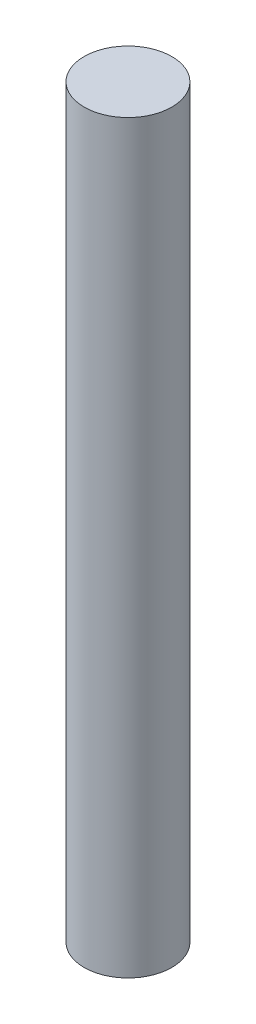
ISO-10303-21;
HEADER;
FILE_DESCRIPTION(('STEP AP214'),'2;1');
FILE_NAME('part.step','',(''),(''),'','','');
FILE_SCHEMA(('AUTOMOTIVE_DESIGN { 1 0 10303 214 1 1 1 1 }'));
ENDSEC;
DATA;
#1=APPLICATION_CONTEXT('core data for automotive mechanical design processes');
#2=APPLICATION_PROTOCOL_DEFINITION('international standard','automotive_design',2000,#1);
#3=PRODUCT_CONTEXT('',#1,'mechanical');
#4=PRODUCT('Part','Part','',(#3));
#5=PRODUCT_RELATED_PRODUCT_CATEGORY('part','',(#4));
#6=PRODUCT_DEFINITION_FORMATION('','',#4);
#7=PRODUCT_DEFINITION_CONTEXT('part definition',#1,'design');
#8=PRODUCT_DEFINITION('design','',#6,#7);
#9=PRODUCT_DEFINITION_SHAPE('','',#8);
#10=(LENGTH_UNIT() NAMED_UNIT(*) SI_UNIT(.MILLI.,.METRE.));
#11=(NAMED_UNIT(*) PLANE_ANGLE_UNIT() SI_UNIT($,.RADIAN.));
#12=(NAMED_UNIT(*) SI_UNIT($,.STERADIAN.) SOLID_ANGLE_UNIT());
#13=UNCERTAINTY_MEASURE_WITH_UNIT(LENGTH_MEASURE(1.E-05),#10,'distance_accuracy_value','');
#14=(GEOMETRIC_REPRESENTATION_CONTEXT(3) GLOBAL_UNCERTAINTY_ASSIGNED_CONTEXT((#13)) GLOBAL_UNIT_ASSIGNED_CONTEXT((#10,
#11,#12)) REPRESENTATION_CONTEXT('',''));
#15=CARTESIAN_POINT('',(0.,0.,0.));
#16=DIRECTION('',(0.,0.,1.));
#17=DIRECTION('',(1.,0.,0.));
#18=AXIS2_PLACEMENT_3D('',#15,#16,#17);
#19=CARTESIAN_POINT('',(0.,34.,0.));
#20=DIRECTION('',(0.,-1.,0.));
#21=DIRECTION('',(0.,0.,-1.));
#22=AXIS2_PLACEMENT_3D('',#19,#20,#21);
#23=CYLINDRICAL_SURFACE('',#22,2.);
#24=CARTESIAN_POINT('',(0.,34.,0.));
#25=DIRECTION('',(0.,1.,0.));
#26=DIRECTION('',(0.,0.,1.));
#27=AXIS2_PLACEMENT_3D('',#24,#25,#26);
#28=CIRCLE('',#27,2.);
#29=CARTESIAN_POINT('',(0.,34.,2.));
#30=VERTEX_POINT('',#29);
#31=EDGE_CURVE('E10',#30,#30,#28,.T.);
#32=ORIENTED_EDGE('',*,*,#31,.F.);
#33=EDGE_LOOP('',(#32));
#34=FACE_BOUND('',#33,.T.);
#35=CARTESIAN_POINT('',(0.,0.,0.));
#36=DIRECTION('',(0.,1.,0.));
#37=DIRECTION('',(0.,0.,1.));
#38=AXIS2_PLACEMENT_3D('',#35,#36,#37);
#39=CIRCLE('',#38,2.);
#40=CARTESIAN_POINT('',(0.,0.,2.));
#41=VERTEX_POINT('',#40);
#42=EDGE_CURVE('E35',#41,#41,#39,.T.);
#43=ORIENTED_EDGE('',*,*,#42,.T.);
#44=EDGE_LOOP('',(#43));
#45=FACE_BOUND('',#44,.T.);
#46=ADVANCED_FACE('F32',(#34,#45),#23,.T.);
#47=CARTESIAN_POINT('',(0.,34.,0.));
#48=DIRECTION('',(0.,1.,0.));
#49=DIRECTION('',(0.,0.,1.));
#50=AXIS2_PLACEMENT_3D('',#47,#48,#49);
#51=PLANE('',#50);
#52=ORIENTED_EDGE('',*,*,#31,.T.);
#53=EDGE_LOOP('',(#52));
#54=FACE_BOUND('',#53,.T.);
#55=ADVANCED_FACE('F47',(#54),#51,.T.);
#56=CARTESIAN_POINT('',(0.,0.,0.));
#57=DIRECTION('',(0.,1.,0.));
#58=DIRECTION('',(0.,0.,1.));
#59=AXIS2_PLACEMENT_3D('',#56,#57,#58);
#60=PLANE('',#59);
#61=ORIENTED_EDGE('',*,*,#42,.F.);
#62=EDGE_LOOP('',(#61));
#63=FACE_BOUND('',#62,.T.);
#64=ADVANCED_FACE('F45',(#63),#60,.F.);
#65=CLOSED_SHELL('',(#46,#55,#64));
#66=MANIFOLD_SOLID_BREP('B2',#65);
#67=ADVANCED_BREP_SHAPE_REPRESENTATION('',(#18,#66),#14);
#68=SHAPE_DEFINITION_REPRESENTATION(#9,#67);
ENDSEC;
END-ISO-10303-21;
